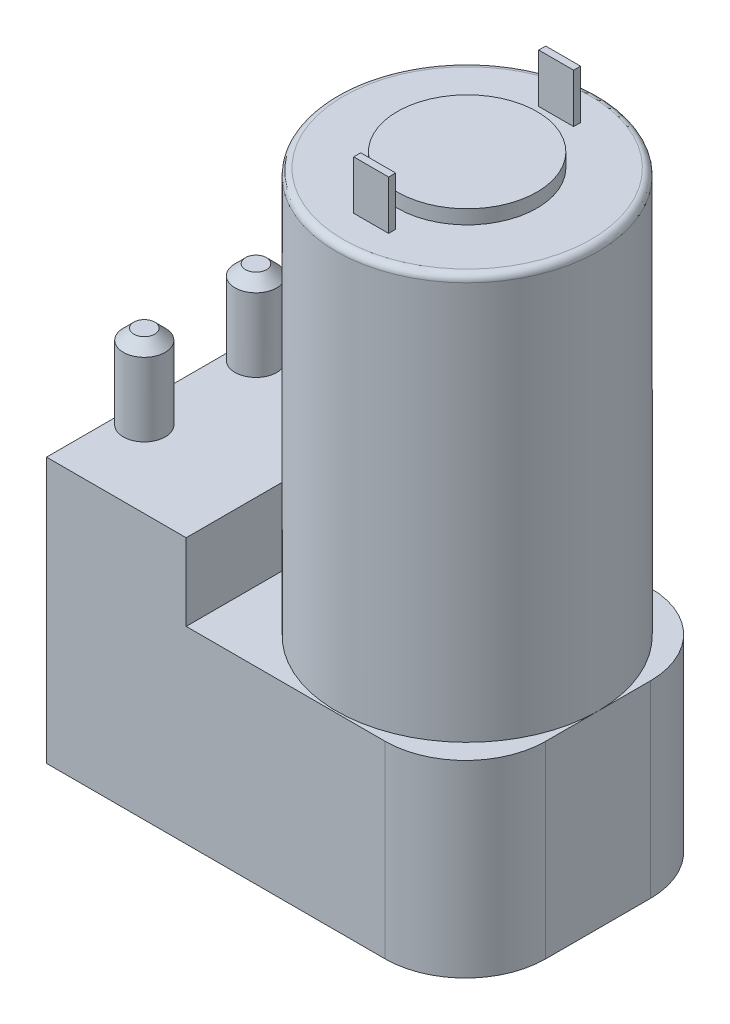
ISO-10303-21;
HEADER;
FILE_DESCRIPTION(('STEP AP214'),'2;1');
FILE_NAME('part.step','',(''),(''),'','','');
FILE_SCHEMA(('AUTOMOTIVE_DESIGN { 1 0 10303 214 1 1 1 1 }'));
ENDSEC;
DATA;
#1=APPLICATION_CONTEXT('core data for automotive mechanical design processes');
#2=APPLICATION_PROTOCOL_DEFINITION('international standard','automotive_design',2000,#1);
#3=PRODUCT_CONTEXT('',#1,'mechanical');
#4=PRODUCT('Part','Part','',(#3));
#5=PRODUCT_RELATED_PRODUCT_CATEGORY('part','',(#4));
#6=PRODUCT_DEFINITION_FORMATION('','',#4);
#7=PRODUCT_DEFINITION_CONTEXT('part definition',#1,'design');
#8=PRODUCT_DEFINITION('design','',#6,#7);
#9=PRODUCT_DEFINITION_SHAPE('','',#8);
#10=(LENGTH_UNIT() NAMED_UNIT(*) SI_UNIT(.MILLI.,.METRE.));
#11=(NAMED_UNIT(*) PLANE_ANGLE_UNIT() SI_UNIT($,.RADIAN.));
#12=(NAMED_UNIT(*) SI_UNIT($,.STERADIAN.) SOLID_ANGLE_UNIT());
#13=UNCERTAINTY_MEASURE_WITH_UNIT(LENGTH_MEASURE(1.E-05),#10,'distance_accuracy_value','');
#14=(GEOMETRIC_REPRESENTATION_CONTEXT(3) GLOBAL_UNCERTAINTY_ASSIGNED_CONTEXT((#13)) GLOBAL_UNIT_ASSIGNED_CONTEXT((#10,
#11,#12)) REPRESENTATION_CONTEXT('',''));
#15=CARTESIAN_POINT('',(0.,0.,0.));
#16=DIRECTION('',(0.,0.,1.));
#17=DIRECTION('',(1.,0.,0.));
#18=AXIS2_PLACEMENT_3D('',#15,#16,#17);
#19=CARTESIAN_POINT('',(41.25,85.,-19.));
#20=DIRECTION('',(0.,1.,0.));
#21=DIRECTION('',(0.,0.,1.));
#22=AXIS2_PLACEMENT_3D('',#19,#20,#21);
#23=PLANE('',#22);
#24=DIRECTION('',(0.,0.,-1.));
#25=VECTOR('',#24,1.);
#26=CARTESIAN_POINT('',(43.75,85.,-5.24999999999998));
#27=LINE('',#26,#25);
#28=CARTESIAN_POINT('',(43.75,85.,-5.24999999999998));
#29=VERTEX_POINT('',#28);
#30=CARTESIAN_POINT('',(43.75,85.,-6.24999999999998));
#31=VERTEX_POINT('',#30);
#32=EDGE_CURVE('E182',#29,#31,#27,.T.);
#33=ORIENTED_EDGE('',*,*,#32,.F.);
#34=DIRECTION('',(1.,0.,0.));
#35=VECTOR('',#34,1.);
#36=CARTESIAN_POINT('',(43.75,85.,-5.24999999999998));
#37=LINE('',#36,#35);
#38=CARTESIAN_POINT('',(38.75,85.,-5.24999999999998));
#39=VERTEX_POINT('',#38);
#40=EDGE_CURVE('E179',#39,#29,#37,.T.);
#41=ORIENTED_EDGE('',*,*,#40,.F.);
#42=DIRECTION('',(0.,0.,1.));
#43=VECTOR('',#42,1.);
#44=CARTESIAN_POINT('',(38.75,85.,-5.24999999999998));
#45=LINE('',#44,#43);
#46=CARTESIAN_POINT('',(38.75,85.,-6.24999999999998));
#47=VERTEX_POINT('',#46);
#48=EDGE_CURVE('E191',#47,#39,#45,.T.);
#49=ORIENTED_EDGE('',*,*,#48,.F.);
#50=DIRECTION('',(-1.,0.,0.));
#51=VECTOR('',#50,1.);
#52=CARTESIAN_POINT('',(38.75,85.,-6.24999999999998));
#53=LINE('',#52,#51);
#54=EDGE_CURVE('E199',#31,#47,#53,.T.);
#55=ORIENTED_EDGE('',*,*,#54,.F.);
#56=EDGE_LOOP('',(#33,#41,#49,#55));
#57=FACE_BOUND('',#56,.T.);
#58=CARTESIAN_POINT('',(41.25,85.,-19.));
#59=DIRECTION('',(0.,1.,0.));
#60=DIRECTION('',(0.,0.,1.));
#61=AXIS2_PLACEMENT_3D('',#58,#59,#60);
#62=CIRCLE('',#61,17.75);
#63=CARTESIAN_POINT('',(41.25,85.,-1.24999999999999));
#64=VERTEX_POINT('',#63);
#65=EDGE_CURVE('E39',#64,#64,#62,.T.);
#66=ORIENTED_EDGE('',*,*,#65,.T.);
#67=EDGE_LOOP('',(#66));
#68=FACE_BOUND('',#67,.T.);
#69=CARTESIAN_POINT('',(41.25,85.,-19.));
#70=DIRECTION('',(0.,1.,0.));
#71=DIRECTION('',(0.,0.,1.));
#72=AXIS2_PLACEMENT_3D('',#69,#70,#71);
#73=CIRCLE('',#72,10.);
#74=CARTESIAN_POINT('',(41.25,85.,-8.99999999999999));
#75=VERTEX_POINT('',#74);
#76=EDGE_CURVE('E215',#75,#75,#73,.T.);
#77=ORIENTED_EDGE('',*,*,#76,.F.);
#78=EDGE_LOOP('',(#77));
#79=FACE_BOUND('',#78,.T.);
#80=DIRECTION('',(1.,0.,0.));
#81=VECTOR('',#80,1.);
#82=CARTESIAN_POINT('',(38.75,85.,-31.75));
#83=LINE('',#82,#81);
#84=CARTESIAN_POINT('',(38.75,85.,-31.75));
#85=VERTEX_POINT('',#84);
#86=CARTESIAN_POINT('',(43.75,85.,-31.75));
#87=VERTEX_POINT('',#86);
#88=EDGE_CURVE('E602',#85,#87,#83,.T.);
#89=ORIENTED_EDGE('',*,*,#88,.F.);
#90=DIRECTION('',(0.,0.,1.));
#91=VECTOR('',#90,1.);
#92=CARTESIAN_POINT('',(38.75,85.,-32.75));
#93=LINE('',#92,#91);
#94=CARTESIAN_POINT('',(38.75,85.,-32.75));
#95=VERTEX_POINT('',#94);
#96=EDGE_CURVE('E177',#95,#85,#93,.T.);
#97=ORIENTED_EDGE('',*,*,#96,.F.);
#98=DIRECTION('',(-1.,0.,0.));
#99=VECTOR('',#98,1.);
#100=CARTESIAN_POINT('',(43.75,85.,-32.75));
#101=LINE('',#100,#99);
#102=CARTESIAN_POINT('',(43.75,85.,-32.75));
#103=VERTEX_POINT('',#102);
#104=EDGE_CURVE('E173',#103,#95,#101,.T.);
#105=ORIENTED_EDGE('',*,*,#104,.F.);
#106=DIRECTION('',(0.,0.,-1.));
#107=VECTOR('',#106,1.);
#108=CARTESIAN_POINT('',(43.75,85.,-32.75));
#109=LINE('',#108,#107);
#110=EDGE_CURVE('E604',#87,#103,#109,.T.);
#111=ORIENTED_EDGE('',*,*,#110,.F.);
#112=EDGE_LOOP('',(#89,#97,#105,#111));
#113=FACE_BOUND('',#112,.T.);
#114=ADVANCED_FACE('F31',(#57,#68,#79,#113),#23,.T.);
#115=CARTESIAN_POINT('',(0.,38.,-38.));
#116=DIRECTION('',(0.,1.,0.));
#117=DIRECTION('',(0.,0.,1.));
#118=AXIS2_PLACEMENT_3D('',#115,#116,#117);
#119=PLANE('',#118);
#120=DIRECTION('',(0.,0.,1.));
#121=VECTOR('',#120,1.);
#122=CARTESIAN_POINT('',(0.,38.,-38.));
#123=LINE('',#122,#121);
#124=CARTESIAN_POINT('',(0.,38.,-27.));
#125=VERTEX_POINT('',#124);
#126=CARTESIAN_POINT('',(0.,38.,-11.));
#127=VERTEX_POINT('',#126);
#128=EDGE_CURVE('E232',#125,#127,#123,.T.);
#129=ORIENTED_EDGE('',*,*,#128,.T.);
#130=CARTESIAN_POINT('',(3.,38.,-11.));
#131=DIRECTION('',(0.,1.,0.));
#132=DIRECTION('',(0.,0.,-1.));
#133=AXIS2_PLACEMENT_3D('',#130,#131,#132);
#134=CIRCLE('',#133,3.);
#135=EDGE_CURVE('E210',#127,#127,#134,.T.);
#136=ORIENTED_EDGE('',*,*,#135,.F.);
#137=CARTESIAN_POINT('',(0.,38.,0.));
#138=VERTEX_POINT('',#137);
#139=EDGE_CURVE('E228',#127,#138,#123,.T.);
#140=ORIENTED_EDGE('',*,*,#139,.T.);
#141=DIRECTION('',(1.,0.,0.));
#142=VECTOR('',#141,1.);
#143=CARTESIAN_POINT('',(0.,38.,0.));
#144=LINE('',#143,#142);
#145=CARTESIAN_POINT('',(20.,38.,0.));
#146=VERTEX_POINT('',#145);
#147=EDGE_CURVE('E231',#138,#146,#144,.T.);
#148=ORIENTED_EDGE('',*,*,#147,.T.);
#149=DIRECTION('',(0.,0.,-1.));
#150=VECTOR('',#149,1.);
#151=CARTESIAN_POINT('',(20.,38.,0.));
#152=LINE('',#151,#150);
#153=CARTESIAN_POINT('',(20.,38.,-38.));
#154=VERTEX_POINT('',#153);
#155=EDGE_CURVE('E234',#146,#154,#152,.T.);
#156=ORIENTED_EDGE('',*,*,#155,.T.);
#157=DIRECTION('',(-1.,0.,0.));
#158=VECTOR('',#157,1.);
#159=CARTESIAN_POINT('',(20.,38.,-38.));
#160=LINE('',#159,#158);
#161=CARTESIAN_POINT('',(0.,38.,-38.));
#162=VERTEX_POINT('',#161);
#163=EDGE_CURVE('E225',#154,#162,#160,.T.);
#164=ORIENTED_EDGE('',*,*,#163,.T.);
#165=EDGE_CURVE('E229',#162,#125,#123,.T.);
#166=ORIENTED_EDGE('',*,*,#165,.T.);
#167=CARTESIAN_POINT('',(3.,38.,-27.));
#168=DIRECTION('',(0.,1.,0.));
#169=DIRECTION('',(0.,0.,1.));
#170=AXIS2_PLACEMENT_3D('',#167,#168,#169);
#171=CIRCLE('',#170,3.);
#172=EDGE_CURVE('E212',#125,#125,#171,.T.);
#173=ORIENTED_EDGE('',*,*,#172,.F.);
#174=EDGE_LOOP('',(#129,#136,#140,#148,#156,#164,#166,#173));
#175=FACE_BOUND('',#174,.T.);
#176=ADVANCED_FACE('F290',(#175),#119,.T.);
#177=CARTESIAN_POINT('',(48.5,27.,-26.5));
#178=DIRECTION('',(0.,-1.,0.));
#179=DIRECTION('',(0.,0.,-1.));
#180=AXIS2_PLACEMENT_3D('',#177,#178,#179);
#181=PLANE('',#180);
#182=DIRECTION('',(0.,0.,-1.));
#183=VECTOR('',#182,1.);
#184=CARTESIAN_POINT('',(60.,27.,-26.5));
#185=LINE('',#184,#183);
#186=CARTESIAN_POINT('',(60.,27.,-11.5));
#187=VERTEX_POINT('',#186);
#188=CARTESIAN_POINT('',(60.,27.,-19.));
#189=VERTEX_POINT('',#188);
#190=EDGE_CURVE('E671',#187,#189,#185,.T.);
#191=ORIENTED_EDGE('',*,*,#190,.T.);
#192=CARTESIAN_POINT('',(41.25,27.,-19.));
#193=DIRECTION('',(0.,1.,0.));
#194=DIRECTION('',(0.,0.,1.));
#195=AXIS2_PLACEMENT_3D('',#192,#193,#194);
#196=CIRCLE('',#195,18.75);
#197=EDGE_CURVE('E219',#189,#189,#196,.T.);
#198=ORIENTED_EDGE('',*,*,#197,.F.);
#199=CARTESIAN_POINT('',(60.,27.,-26.5));
#200=VERTEX_POINT('',#199);
#201=EDGE_CURVE('E657',#189,#200,#185,.T.);
#202=ORIENTED_EDGE('',*,*,#201,.T.);
#203=CARTESIAN_POINT('',(48.5,27.,-26.5));
#204=DIRECTION('',(0.,1.,0.));
#205=DIRECTION('',(0.,0.,-1.));
#206=AXIS2_PLACEMENT_3D('',#203,#204,#205);
#207=CIRCLE('',#206,11.5);
#208=CARTESIAN_POINT('',(48.5,27.,-38.));
#209=VERTEX_POINT('',#208);
#210=EDGE_CURVE('E644',#200,#209,#207,.T.);
#211=ORIENTED_EDGE('',*,*,#210,.T.);
#212=DIRECTION('',(-1.,0.,0.));
#213=VECTOR('',#212,1.);
#214=CARTESIAN_POINT('',(0.,27.,-38.));
#215=LINE('',#214,#213);
#216=CARTESIAN_POINT('',(20.,27.,-38.));
#217=VERTEX_POINT('',#216);
#218=EDGE_CURVE('E245',#209,#217,#215,.T.);
#219=ORIENTED_EDGE('',*,*,#218,.T.);
#220=DIRECTION('',(0.,0.,-1.));
#221=VECTOR('',#220,1.);
#222=CARTESIAN_POINT('',(20.,27.,0.));
#223=LINE('',#222,#221);
#224=CARTESIAN_POINT('',(20.,27.,0.));
#225=VERTEX_POINT('',#224);
#226=EDGE_CURVE('E224',#225,#217,#223,.T.);
#227=ORIENTED_EDGE('',*,*,#226,.F.);
#228=DIRECTION('',(1.,0.,0.));
#229=VECTOR('',#228,1.);
#230=CARTESIAN_POINT('',(0.,27.,0.));
#231=LINE('',#230,#229);
#232=CARTESIAN_POINT('',(48.5,27.,0.));
#233=VERTEX_POINT('',#232);
#234=EDGE_CURVE('E654',#225,#233,#231,.T.);
#235=ORIENTED_EDGE('',*,*,#234,.T.);
#236=CARTESIAN_POINT('',(48.5,27.,-11.5));
#237=DIRECTION('',(0.,1.,0.));
#238=DIRECTION('',(0.,0.,-1.));
#239=AXIS2_PLACEMENT_3D('',#236,#237,#238);
#240=CIRCLE('',#239,11.5);
#241=EDGE_CURVE('E655',#233,#187,#240,.T.);
#242=ORIENTED_EDGE('',*,*,#241,.T.);
#243=EDGE_LOOP('',(#191,#198,#202,#211,#219,#227,#235,#242));
#244=FACE_BOUND('',#243,.T.);
#245=ADVANCED_FACE('F296',(#244),#181,.F.);
#246=CARTESIAN_POINT('',(0.,27.,0.));
#247=DIRECTION('',(1.,0.,0.));
#248=DIRECTION('',(0.,0.,-1.));
#249=AXIS2_PLACEMENT_3D('',#246,#247,#248);
#250=PLANE('',#249);
#251=DIRECTION('',(0.,0.,1.));
#252=VECTOR('',#251,1.);
#253=CARTESIAN_POINT('',(0.,0.,0.));
#254=LINE('',#253,#252);
#255=CARTESIAN_POINT('',(0.,0.,-38.));
#256=VERTEX_POINT('',#255);
#257=CARTESIAN_POINT('',(0.,0.,0.));
#258=VERTEX_POINT('',#257);
#259=EDGE_CURVE('E255',#256,#258,#254,.T.);
#260=ORIENTED_EDGE('',*,*,#259,.T.);
#261=DIRECTION('',(0.,-1.,0.));
#262=VECTOR('',#261,1.);
#263=CARTESIAN_POINT('',(0.,27.,0.));
#264=LINE('',#263,#262);
#265=EDGE_CURVE('E262',#138,#258,#264,.T.);
#266=ORIENTED_EDGE('',*,*,#265,.F.);
#267=ORIENTED_EDGE('',*,*,#139,.F.);
#268=ORIENTED_EDGE('',*,*,#128,.F.);
#269=ORIENTED_EDGE('',*,*,#165,.F.);
#270=DIRECTION('',(0.,-1.,0.));
#271=VECTOR('',#270,1.);
#272=CARTESIAN_POINT('',(0.,27.,-38.));
#273=LINE('',#272,#271);
#274=EDGE_CURVE('E380',#162,#256,#273,.T.);
#275=ORIENTED_EDGE('',*,*,#274,.T.);
#276=EDGE_LOOP('',(#260,#266,#267,#268,#269,#275));
#277=FACE_BOUND('',#276,.T.);
#278=ADVANCED_FACE('F315',(#277),#250,.F.);
#279=CARTESIAN_POINT('',(0.,27.,0.));
#280=DIRECTION('',(0.,0.,-1.));
#281=DIRECTION('',(-1.,0.,0.));
#282=AXIS2_PLACEMENT_3D('',#279,#280,#281);
#283=PLANE('',#282);
#284=DIRECTION('',(1.,0.,0.));
#285=VECTOR('',#284,1.);
#286=CARTESIAN_POINT('',(0.,0.,0.));
#287=LINE('',#286,#285);
#288=CARTESIAN_POINT('',(48.5,0.,0.));
#289=VERTEX_POINT('',#288);
#290=EDGE_CURVE('E666',#258,#289,#287,.T.);
#291=ORIENTED_EDGE('',*,*,#290,.T.);
#292=DIRECTION('',(0.,-1.,0.));
#293=VECTOR('',#292,1.);
#294=CARTESIAN_POINT('',(48.5,27.,0.));
#295=LINE('',#294,#293);
#296=EDGE_CURVE('E372',#233,#289,#295,.T.);
#297=ORIENTED_EDGE('',*,*,#296,.F.);
#298=ORIENTED_EDGE('',*,*,#234,.F.);
#299=DIRECTION('',(0.,-1.,0.));
#300=VECTOR('',#299,1.);
#301=CARTESIAN_POINT('',(20.,38.,0.));
#302=LINE('',#301,#300);
#303=EDGE_CURVE('E250',#146,#225,#302,.T.);
#304=ORIENTED_EDGE('',*,*,#303,.F.);
#305=ORIENTED_EDGE('',*,*,#147,.F.);
#306=ORIENTED_EDGE('',*,*,#265,.T.);
#307=EDGE_LOOP('',(#291,#297,#298,#304,#305,#306));
#308=FACE_BOUND('',#307,.T.);
#309=ADVANCED_FACE('F335',(#308),#283,.F.);
#310=CARTESIAN_POINT('',(48.5,27.,-11.5));
#311=DIRECTION('',(0.,-1.,0.));
#312=DIRECTION('',(0.,0.,-1.));
#313=AXIS2_PLACEMENT_3D('',#310,#311,#312);
#314=CYLINDRICAL_SURFACE('',#313,11.5);
#315=CARTESIAN_POINT('',(48.5,0.,-11.5));
#316=DIRECTION('',(0.,1.,0.));
#317=DIRECTION('',(0.,0.,-1.));
#318=AXIS2_PLACEMENT_3D('',#315,#316,#317);
#319=CIRCLE('',#318,11.5);
#320=CARTESIAN_POINT('',(60.,0.,-11.5));
#321=VERTEX_POINT('',#320);
#322=EDGE_CURVE('E662',#289,#321,#319,.T.);
#323=ORIENTED_EDGE('',*,*,#322,.T.);
#324=DIRECTION('',(0.,-1.,0.));
#325=VECTOR('',#324,1.);
#326=CARTESIAN_POINT('',(60.,27.,-11.5));
#327=LINE('',#326,#325);
#328=EDGE_CURVE('E650',#187,#321,#327,.T.);
#329=ORIENTED_EDGE('',*,*,#328,.F.);
#330=ORIENTED_EDGE('',*,*,#241,.F.);
#331=ORIENTED_EDGE('',*,*,#296,.T.);
#332=EDGE_LOOP('',(#323,#329,#330,#331));
#333=FACE_BOUND('',#332,.T.);
#334=ADVANCED_FACE('F331',(#333),#314,.T.);
#335=CARTESIAN_POINT('',(60.,27.,-26.5));
#336=DIRECTION('',(-1.,0.,0.));
#337=DIRECTION('',(0.,0.,1.));
#338=AXIS2_PLACEMENT_3D('',#335,#336,#337);
#339=PLANE('',#338);
#340=DIRECTION('',(0.,0.,-1.));
#341=VECTOR('',#340,1.);
#342=CARTESIAN_POINT('',(60.,0.,-26.5));
#343=LINE('',#342,#341);
#344=CARTESIAN_POINT('',(60.,0.,-26.5));
#345=VERTEX_POINT('',#344);
#346=EDGE_CURVE('E659',#321,#345,#343,.T.);
#347=ORIENTED_EDGE('',*,*,#346,.T.);
#348=DIRECTION('',(0.,-1.,0.));
#349=VECTOR('',#348,1.);
#350=CARTESIAN_POINT('',(60.,27.,-26.5));
#351=LINE('',#350,#349);
#352=EDGE_CURVE('E642',#200,#345,#351,.T.);
#353=ORIENTED_EDGE('',*,*,#352,.F.);
#354=ORIENTED_EDGE('',*,*,#201,.F.);
#355=ORIENTED_EDGE('',*,*,#190,.F.);
#356=ORIENTED_EDGE('',*,*,#328,.T.);
#357=EDGE_LOOP('',(#347,#353,#354,#355,#356));
#358=FACE_BOUND('',#357,.T.);
#359=ADVANCED_FACE('F327',(#358),#339,.F.);
#360=CARTESIAN_POINT('',(48.5,27.,-26.5));
#361=DIRECTION('',(0.,-1.,0.));
#362=DIRECTION('',(0.,0.,-1.));
#363=AXIS2_PLACEMENT_3D('',#360,#361,#362);
#364=CYLINDRICAL_SURFACE('',#363,11.5);
#365=CARTESIAN_POINT('',(48.5,0.,-26.5));
#366=DIRECTION('',(0.,1.,0.));
#367=DIRECTION('',(0.,0.,-1.));
#368=AXIS2_PLACEMENT_3D('',#365,#366,#367);
#369=CIRCLE('',#368,11.5);
#370=CARTESIAN_POINT('',(48.5,0.,-38.));
#371=VERTEX_POINT('',#370);
#372=EDGE_CURVE('E658',#345,#371,#369,.T.);
#373=ORIENTED_EDGE('',*,*,#372,.T.);
#374=DIRECTION('',(0.,-1.,0.));
#375=VECTOR('',#374,1.);
#376=CARTESIAN_POINT('',(48.5,27.,-38.));
#377=LINE('',#376,#375);
#378=EDGE_CURVE('E384',#209,#371,#377,.T.);
#379=ORIENTED_EDGE('',*,*,#378,.F.);
#380=ORIENTED_EDGE('',*,*,#210,.F.);
#381=ORIENTED_EDGE('',*,*,#352,.T.);
#382=EDGE_LOOP('',(#373,#379,#380,#381));
#383=FACE_BOUND('',#382,.T.);
#384=ADVANCED_FACE('F323',(#383),#364,.T.);
#385=CARTESIAN_POINT('',(0.,27.,-38.));
#386=DIRECTION('',(0.,0.,1.));
#387=DIRECTION('',(1.,0.,0.));
#388=AXIS2_PLACEMENT_3D('',#385,#386,#387);
#389=PLANE('',#388);
#390=DIRECTION('',(-1.,0.,0.));
#391=VECTOR('',#390,1.);
#392=CARTESIAN_POINT('',(0.,0.,-38.));
#393=LINE('',#392,#391);
#394=EDGE_CURVE('E383',#371,#256,#393,.T.);
#395=ORIENTED_EDGE('',*,*,#394,.T.);
#396=ORIENTED_EDGE('',*,*,#274,.F.);
#397=ORIENTED_EDGE('',*,*,#163,.F.);
#398=DIRECTION('',(0.,-1.,0.));
#399=VECTOR('',#398,1.);
#400=CARTESIAN_POINT('',(20.,38.,-38.));
#401=LINE('',#400,#399);
#402=EDGE_CURVE('E236',#154,#217,#401,.T.);
#403=ORIENTED_EDGE('',*,*,#402,.T.);
#404=ORIENTED_EDGE('',*,*,#218,.F.);
#405=ORIENTED_EDGE('',*,*,#378,.T.);
#406=EDGE_LOOP('',(#395,#396,#397,#403,#404,#405));
#407=FACE_BOUND('',#406,.T.);
#408=ADVANCED_FACE('F319',(#407),#389,.F.);
#409=CARTESIAN_POINT('',(48.5,0.,-26.5));
#410=DIRECTION('',(0.,-1.,0.));
#411=DIRECTION('',(0.,0.,-1.));
#412=AXIS2_PLACEMENT_3D('',#409,#410,#411);
#413=PLANE('',#412);
#414=ORIENTED_EDGE('',*,*,#259,.F.);
#415=ORIENTED_EDGE('',*,*,#394,.F.);
#416=ORIENTED_EDGE('',*,*,#372,.F.);
#417=ORIENTED_EDGE('',*,*,#346,.F.);
#418=ORIENTED_EDGE('',*,*,#322,.F.);
#419=ORIENTED_EDGE('',*,*,#290,.F.);
#420=EDGE_LOOP('',(#414,#415,#416,#417,#418,#419));
#421=FACE_BOUND('',#420,.T.);
#422=ADVANCED_FACE('F311',(#421),#413,.T.);
#423=CARTESIAN_POINT('',(20.,38.,0.));
#424=DIRECTION('',(-1.,0.,0.));
#425=DIRECTION('',(0.,0.,1.));
#426=AXIS2_PLACEMENT_3D('',#423,#424,#425);
#427=PLANE('',#426);
#428=ORIENTED_EDGE('',*,*,#226,.T.);
#429=ORIENTED_EDGE('',*,*,#402,.F.);
#430=ORIENTED_EDGE('',*,*,#155,.F.);
#431=ORIENTED_EDGE('',*,*,#303,.T.);
#432=EDGE_LOOP('',(#428,#429,#430,#431));
#433=FACE_BOUND('',#432,.T.);
#434=ADVANCED_FACE('F306',(#433),#427,.F.);
#435=CARTESIAN_POINT('',(41.25,85.,-19.));
#436=DIRECTION('',(0.,-1.,0.));
#437=DIRECTION('',(0.,0.,-1.));
#438=AXIS2_PLACEMENT_3D('',#435,#436,#437);
#439=CYLINDRICAL_SURFACE('',#438,18.75);
#440=CARTESIAN_POINT('',(41.25,84.,-19.));
#441=DIRECTION('',(0.,1.,0.));
#442=DIRECTION('',(0.,0.,1.));
#443=AXIS2_PLACEMENT_3D('',#440,#441,#442);
#444=CIRCLE('',#443,18.75);
#445=CARTESIAN_POINT('',(41.25,84.,-0.24999999999999));
#446=VERTEX_POINT('',#445);
#447=EDGE_CURVE('E11',#446,#446,#444,.F.);
#448=ORIENTED_EDGE('',*,*,#447,.T.);
#449=EDGE_LOOP('',(#448));
#450=FACE_BOUND('',#449,.T.);
#451=ORIENTED_EDGE('',*,*,#197,.T.);
#452=EDGE_LOOP('',(#451));
#453=FACE_BOUND('',#452,.T.);
#454=ADVANCED_FACE('F304',(#450,#453),#439,.T.);
#455=CARTESIAN_POINT('',(41.25,87.,-19.));
#456=DIRECTION('',(0.,-1.,0.));
#457=DIRECTION('',(0.,0.,-1.));
#458=AXIS2_PLACEMENT_3D('',#455,#456,#457);
#459=CYLINDRICAL_SURFACE('',#458,10.);
#460=CARTESIAN_POINT('',(41.25,87.,-19.));
#461=DIRECTION('',(0.,1.,0.));
#462=DIRECTION('',(0.,0.,1.));
#463=AXIS2_PLACEMENT_3D('',#460,#461,#462);
#464=CIRCLE('',#463,10.);
#465=CARTESIAN_POINT('',(41.25,87.,-8.99999999999999));
#466=VERTEX_POINT('',#465);
#467=EDGE_CURVE('E216',#466,#466,#464,.T.);
#468=ORIENTED_EDGE('',*,*,#467,.F.);
#469=EDGE_LOOP('',(#468));
#470=FACE_BOUND('',#469,.T.);
#471=ORIENTED_EDGE('',*,*,#76,.T.);
#472=EDGE_LOOP('',(#471));
#473=FACE_BOUND('',#472,.T.);
#474=ADVANCED_FACE('F302',(#470,#473),#459,.T.);
#475=CARTESIAN_POINT('',(41.25,87.,-19.));
#476=DIRECTION('',(0.,1.,0.));
#477=DIRECTION('',(0.,0.,1.));
#478=AXIS2_PLACEMENT_3D('',#475,#476,#477);
#479=PLANE('',#478);
#480=ORIENTED_EDGE('',*,*,#467,.T.);
#481=EDGE_LOOP('',(#480));
#482=FACE_BOUND('',#481,.T.);
#483=ADVANCED_FACE('F389',(#482),#479,.T.);
#484=CARTESIAN_POINT('',(3.,50.,-27.));
#485=DIRECTION('',(0.,-1.,0.));
#486=DIRECTION('',(0.,0.,-1.));
#487=AXIS2_PLACEMENT_3D('',#484,#485,#486);
#488=CYLINDRICAL_SURFACE('',#487,3.);
#489=CARTESIAN_POINT('',(3.,48.5,-27.));
#490=DIRECTION('',(0.,1.,0.));
#491=DIRECTION('',(0.,0.,1.));
#492=AXIS2_PLACEMENT_3D('',#489,#490,#491);
#493=CIRCLE('',#492,3.);
#494=CARTESIAN_POINT('',(3.,48.5,-24.));
#495=VERTEX_POINT('',#494);
#496=EDGE_CURVE('E268',#495,#495,#493,.F.);
#497=ORIENTED_EDGE('',*,*,#496,.T.);
#498=EDGE_LOOP('',(#497));
#499=FACE_BOUND('',#498,.T.);
#500=ORIENTED_EDGE('',*,*,#172,.T.);
#501=EDGE_LOOP('',(#500));
#502=FACE_BOUND('',#501,.T.);
#503=ADVANCED_FACE('F387',(#499,#502),#488,.T.);
#504=CARTESIAN_POINT('',(3.,50.,-27.));
#505=DIRECTION('',(0.,1.,0.));
#506=DIRECTION('',(0.,0.,1.));
#507=AXIS2_PLACEMENT_3D('',#504,#505,#506);
#508=PLANE('',#507);
#509=CARTESIAN_POINT('',(3.,50.,-27.));
#510=DIRECTION('',(0.,1.,0.));
#511=DIRECTION('',(0.,0.,1.));
#512=AXIS2_PLACEMENT_3D('',#509,#510,#511);
#513=CIRCLE('',#512,1.5);
#514=CARTESIAN_POINT('',(3.,50.,-25.5));
#515=VERTEX_POINT('',#514);
#516=EDGE_CURVE('E265',#515,#515,#513,.T.);
#517=ORIENTED_EDGE('',*,*,#516,.T.);
#518=EDGE_LOOP('',(#517));
#519=FACE_BOUND('',#518,.T.);
#520=ADVANCED_FACE('F358',(#519),#508,.T.);
#521=CARTESIAN_POINT('',(3.,50.,-11.));
#522=DIRECTION('',(0.,-1.,0.));
#523=DIRECTION('',(0.,0.,-1.));
#524=AXIS2_PLACEMENT_3D('',#521,#522,#523);
#525=CYLINDRICAL_SURFACE('',#524,3.);
#526=CARTESIAN_POINT('',(3.,48.5,-11.));
#527=DIRECTION('',(0.,-1.,0.));
#528=DIRECTION('',(0.,0.,-1.));
#529=AXIS2_PLACEMENT_3D('',#526,#527,#528);
#530=CIRCLE('',#529,3.);
#531=CARTESIAN_POINT('',(3.,48.5,-14.));
#532=VERTEX_POINT('',#531);
#533=EDGE_CURVE('E261',#532,#532,#530,.T.);
#534=ORIENTED_EDGE('',*,*,#533,.T.);
#535=EDGE_LOOP('',(#534));
#536=FACE_BOUND('',#535,.T.);
#537=ORIENTED_EDGE('',*,*,#135,.T.);
#538=EDGE_LOOP('',(#537));
#539=FACE_BOUND('',#538,.T.);
#540=ADVANCED_FACE('F349',(#536,#539),#525,.T.);
#541=CARTESIAN_POINT('',(3.,50.,-11.));
#542=DIRECTION('',(0.,-1.,0.));
#543=DIRECTION('',(0.,0.,-1.));
#544=AXIS2_PLACEMENT_3D('',#541,#542,#543);
#545=PLANE('',#544);
#546=CARTESIAN_POINT('',(3.,50.,-11.));
#547=DIRECTION('',(0.,-1.,0.));
#548=DIRECTION('',(0.,0.,-1.));
#549=AXIS2_PLACEMENT_3D('',#546,#547,#548);
#550=CIRCLE('',#549,1.5);
#551=CARTESIAN_POINT('',(3.,50.,-12.5));
#552=VERTEX_POINT('',#551);
#553=EDGE_CURVE('E258',#552,#552,#550,.F.);
#554=ORIENTED_EDGE('',*,*,#553,.T.);
#555=EDGE_LOOP('',(#554));
#556=FACE_BOUND('',#555,.T.);
#557=ADVANCED_FACE('F344',(#556),#545,.F.);
#558=CARTESIAN_POINT('',(3.,50.,-11.));
#559=DIRECTION('',(0.,-1.,0.));
#560=DIRECTION('',(0.,0.,-1.));
#561=AXIS2_PLACEMENT_3D('',#558,#559,#560);
#562=CONICAL_SURFACE('',#561,1.5,0.785398163397449);
#563=ORIENTED_EDGE('',*,*,#533,.F.);
#564=EDGE_LOOP('',(#563));
#565=FACE_BOUND('',#564,.T.);
#566=ORIENTED_EDGE('',*,*,#553,.F.);
#567=EDGE_LOOP('',(#566));
#568=FACE_BOUND('',#567,.T.);
#569=ADVANCED_FACE('F286',(#565,#568),#562,.T.);
#570=CARTESIAN_POINT('',(3.,50.,-27.));
#571=DIRECTION('',(0.,-1.,0.));
#572=DIRECTION('',(0.,0.,-1.));
#573=AXIS2_PLACEMENT_3D('',#570,#571,#572);
#574=CONICAL_SURFACE('',#573,1.5,0.785398163397444);
#575=ORIENTED_EDGE('',*,*,#496,.F.);
#576=EDGE_LOOP('',(#575));
#577=FACE_BOUND('',#576,.T.);
#578=ORIENTED_EDGE('',*,*,#516,.F.);
#579=EDGE_LOOP('',(#578));
#580=FACE_BOUND('',#579,.T.);
#581=ADVANCED_FACE('F277',(#577,#580),#574,.T.);
#582=CARTESIAN_POINT('',(41.25,84.,-19.));
#583=DIRECTION('',(0.,1.,0.));
#584=DIRECTION('',(0.,0.,1.));
#585=AXIS2_PLACEMENT_3D('',#582,#583,#584);
#586=TOROIDAL_SURFACE('',#585,17.75,1.);
#587=ORIENTED_EDGE('',*,*,#447,.F.);
#588=EDGE_LOOP('',(#587));
#589=FACE_BOUND('',#588,.T.);
#590=ORIENTED_EDGE('',*,*,#65,.F.);
#591=EDGE_LOOP('',(#590));
#592=FACE_BOUND('',#591,.T.);
#593=ADVANCED_FACE('F33',(#589,#592),#586,.T.);
#594=CARTESIAN_POINT('',(43.75,92.,-5.24999999999998));
#595=DIRECTION('',(0.,0.,-1.));
#596=DIRECTION('',(-1.,0.,0.));
#597=AXIS2_PLACEMENT_3D('',#594,#595,#596);
#598=PLANE('',#597);
#599=ORIENTED_EDGE('',*,*,#40,.T.);
#600=DIRECTION('',(0.,-1.,0.));
#601=VECTOR('',#600,1.);
#602=CARTESIAN_POINT('',(43.75,92.,-5.24999999999998));
#603=LINE('',#602,#601);
#604=CARTESIAN_POINT('',(43.75,92.,-5.24999999999998));
#605=VERTEX_POINT('',#604);
#606=EDGE_CURVE('E208',#605,#29,#603,.T.);
#607=ORIENTED_EDGE('',*,*,#606,.F.);
#608=DIRECTION('',(1.,0.,0.));
#609=VECTOR('',#608,1.);
#610=CARTESIAN_POINT('',(43.75,92.,-5.24999999999998));
#611=LINE('',#610,#609);
#612=CARTESIAN_POINT('',(38.75,92.,-5.24999999999998));
#613=VERTEX_POINT('',#612);
#614=EDGE_CURVE('E187',#613,#605,#611,.T.);
#615=ORIENTED_EDGE('',*,*,#614,.F.);
#616=DIRECTION('',(0.,-1.,0.));
#617=VECTOR('',#616,1.);
#618=CARTESIAN_POINT('',(38.75,92.,-5.24999999999998));
#619=LINE('',#618,#617);
#620=EDGE_CURVE('E196',#613,#39,#619,.T.);
#621=ORIENTED_EDGE('',*,*,#620,.T.);
#622=EDGE_LOOP('',(#599,#607,#615,#621));
#623=FACE_BOUND('',#622,.T.);
#624=ADVANCED_FACE('F276',(#623),#598,.F.);
#625=CARTESIAN_POINT('',(43.75,92.,-5.24999999999998));
#626=DIRECTION('',(-1.,0.,0.));
#627=DIRECTION('',(0.,0.,1.));
#628=AXIS2_PLACEMENT_3D('',#625,#626,#627);
#629=PLANE('',#628);
#630=ORIENTED_EDGE('',*,*,#32,.T.);
#631=DIRECTION('',(0.,-1.,0.));
#632=VECTOR('',#631,1.);
#633=CARTESIAN_POINT('',(43.75,92.,-6.24999999999998));
#634=LINE('',#633,#632);
#635=CARTESIAN_POINT('',(43.75,92.,-6.24999999999998));
#636=VERTEX_POINT('',#635);
#637=EDGE_CURVE('E205',#636,#31,#634,.T.);
#638=ORIENTED_EDGE('',*,*,#637,.F.);
#639=DIRECTION('',(0.,0.,-1.));
#640=VECTOR('',#639,1.);
#641=CARTESIAN_POINT('',(43.75,92.,-5.24999999999998));
#642=LINE('',#641,#640);
#643=EDGE_CURVE('E190',#605,#636,#642,.T.);
#644=ORIENTED_EDGE('',*,*,#643,.F.);
#645=ORIENTED_EDGE('',*,*,#606,.T.);
#646=EDGE_LOOP('',(#630,#638,#644,#645));
#647=FACE_BOUND('',#646,.T.);
#648=ADVANCED_FACE('F283',(#647),#629,.F.);
#649=CARTESIAN_POINT('',(38.75,92.,-6.24999999999998));
#650=DIRECTION('',(0.,0.,1.));
#651=DIRECTION('',(1.,0.,0.));
#652=AXIS2_PLACEMENT_3D('',#649,#650,#651);
#653=PLANE('',#652);
#654=ORIENTED_EDGE('',*,*,#54,.T.);
#655=DIRECTION('',(0.,-1.,0.));
#656=VECTOR('',#655,1.);
#657=CARTESIAN_POINT('',(38.75,92.,-6.24999999999998));
#658=LINE('',#657,#656);
#659=CARTESIAN_POINT('',(38.75,92.,-6.24999999999998));
#660=VERTEX_POINT('',#659);
#661=EDGE_CURVE('E54',#660,#47,#658,.T.);
#662=ORIENTED_EDGE('',*,*,#661,.F.);
#663=DIRECTION('',(-1.,0.,0.));
#664=VECTOR('',#663,1.);
#665=CARTESIAN_POINT('',(38.75,92.,-6.24999999999998));
#666=LINE('',#665,#664);
#667=EDGE_CURVE('E193',#636,#660,#666,.T.);
#668=ORIENTED_EDGE('',*,*,#667,.F.);
#669=ORIENTED_EDGE('',*,*,#637,.T.);
#670=EDGE_LOOP('',(#654,#662,#668,#669));
#671=FACE_BOUND('',#670,.T.);
#672=ADVANCED_FACE('F402',(#671),#653,.F.);
#673=CARTESIAN_POINT('',(38.75,92.,-5.24999999999998));
#674=DIRECTION('',(1.,0.,0.));
#675=DIRECTION('',(0.,0.,-1.));
#676=AXIS2_PLACEMENT_3D('',#673,#674,#675);
#677=PLANE('',#676);
#678=ORIENTED_EDGE('',*,*,#48,.T.);
#679=ORIENTED_EDGE('',*,*,#620,.F.);
#680=DIRECTION('',(0.,0.,1.));
#681=VECTOR('',#680,1.);
#682=CARTESIAN_POINT('',(38.75,92.,-5.24999999999998));
#683=LINE('',#682,#681);
#684=EDGE_CURVE('E195',#660,#613,#683,.T.);
#685=ORIENTED_EDGE('',*,*,#684,.F.);
#686=ORIENTED_EDGE('',*,*,#661,.T.);
#687=EDGE_LOOP('',(#678,#679,#685,#686));
#688=FACE_BOUND('',#687,.T.);
#689=ADVANCED_FACE('F406',(#688),#677,.F.);
#690=CARTESIAN_POINT('',(38.75,92.,-5.24999999999998));
#691=DIRECTION('',(0.,-1.,0.));
#692=DIRECTION('',(0.,0.,-1.));
#693=AXIS2_PLACEMENT_3D('',#690,#691,#692);
#694=PLANE('',#693);
#695=ORIENTED_EDGE('',*,*,#614,.T.);
#696=ORIENTED_EDGE('',*,*,#643,.T.);
#697=ORIENTED_EDGE('',*,*,#667,.T.);
#698=ORIENTED_EDGE('',*,*,#684,.T.);
#699=EDGE_LOOP('',(#695,#696,#697,#698));
#700=FACE_BOUND('',#699,.T.);
#701=ADVANCED_FACE('F410',(#700),#694,.F.);
#702=CARTESIAN_POINT('',(38.75,92.,-32.75));
#703=DIRECTION('',(1.,0.,0.));
#704=DIRECTION('',(0.,0.,-1.));
#705=AXIS2_PLACEMENT_3D('',#702,#703,#704);
#706=PLANE('',#705);
#707=ORIENTED_EDGE('',*,*,#96,.T.);
#708=DIRECTION('',(0.,-1.,0.));
#709=VECTOR('',#708,1.);
#710=CARTESIAN_POINT('',(38.75,92.,-31.75));
#711=LINE('',#710,#709);
#712=CARTESIAN_POINT('',(38.75,92.,-31.75));
#713=VERTEX_POINT('',#712);
#714=EDGE_CURVE('E158',#713,#85,#711,.T.);
#715=ORIENTED_EDGE('',*,*,#714,.F.);
#716=DIRECTION('',(0.,0.,1.));
#717=VECTOR('',#716,1.);
#718=CARTESIAN_POINT('',(38.75,92.,-32.75));
#719=LINE('',#718,#717);
#720=CARTESIAN_POINT('',(38.75,92.,-32.75));
#721=VERTEX_POINT('',#720);
#722=EDGE_CURVE('E165',#721,#713,#719,.T.);
#723=ORIENTED_EDGE('',*,*,#722,.F.);
#724=DIRECTION('',(0.,-1.,0.));
#725=VECTOR('',#724,1.);
#726=CARTESIAN_POINT('',(38.75,92.,-32.75));
#727=LINE('',#726,#725);
#728=EDGE_CURVE('E611',#721,#95,#727,.T.);
#729=ORIENTED_EDGE('',*,*,#728,.T.);
#730=EDGE_LOOP('',(#707,#715,#723,#729));
#731=FACE_BOUND('',#730,.T.);
#732=ADVANCED_FACE('F175',(#731),#706,.F.);
#733=CARTESIAN_POINT('',(38.75,92.,-31.75));
#734=DIRECTION('',(0.,0.,-1.));
#735=DIRECTION('',(-1.,0.,0.));
#736=AXIS2_PLACEMENT_3D('',#733,#734,#735);
#737=PLANE('',#736);
#738=ORIENTED_EDGE('',*,*,#88,.T.);
#739=DIRECTION('',(0.,-1.,0.));
#740=VECTOR('',#739,1.);
#741=CARTESIAN_POINT('',(43.75,92.,-31.75));
#742=LINE('',#741,#740);
#743=CARTESIAN_POINT('',(43.75,92.,-31.75));
#744=VERTEX_POINT('',#743);
#745=EDGE_CURVE('E161',#744,#87,#742,.T.);
#746=ORIENTED_EDGE('',*,*,#745,.F.);
#747=DIRECTION('',(1.,0.,0.));
#748=VECTOR('',#747,1.);
#749=CARTESIAN_POINT('',(38.75,92.,-31.75));
#750=LINE('',#749,#748);
#751=EDGE_CURVE('E154',#713,#744,#750,.T.);
#752=ORIENTED_EDGE('',*,*,#751,.F.);
#753=ORIENTED_EDGE('',*,*,#714,.T.);
#754=EDGE_LOOP('',(#738,#746,#752,#753));
#755=FACE_BOUND('',#754,.T.);
#756=ADVANCED_FACE('F156',(#755),#737,.F.);
#757=CARTESIAN_POINT('',(43.75,92.,-32.75));
#758=DIRECTION('',(-1.,0.,0.));
#759=DIRECTION('',(0.,0.,1.));
#760=AXIS2_PLACEMENT_3D('',#757,#758,#759);
#761=PLANE('',#760);
#762=ORIENTED_EDGE('',*,*,#110,.T.);
#763=DIRECTION('',(0.,-1.,0.));
#764=VECTOR('',#763,1.);
#765=CARTESIAN_POINT('',(43.75,92.,-32.75));
#766=LINE('',#765,#764);
#767=CARTESIAN_POINT('',(43.75,92.,-32.75));
#768=VERTEX_POINT('',#767);
#769=EDGE_CURVE('E46',#768,#103,#766,.T.);
#770=ORIENTED_EDGE('',*,*,#769,.F.);
#771=DIRECTION('',(0.,0.,-1.));
#772=VECTOR('',#771,1.);
#773=CARTESIAN_POINT('',(43.75,92.,-32.75));
#774=LINE('',#773,#772);
#775=EDGE_CURVE('E164',#744,#768,#774,.T.);
#776=ORIENTED_EDGE('',*,*,#775,.F.);
#777=ORIENTED_EDGE('',*,*,#745,.T.);
#778=EDGE_LOOP('',(#762,#770,#776,#777));
#779=FACE_BOUND('',#778,.T.);
#780=ADVANCED_FACE('F418',(#779),#761,.F.);
#781=CARTESIAN_POINT('',(43.75,92.,-32.75));
#782=DIRECTION('',(0.,0.,1.));
#783=DIRECTION('',(1.,0.,0.));
#784=AXIS2_PLACEMENT_3D('',#781,#782,#783);
#785=PLANE('',#784);
#786=ORIENTED_EDGE('',*,*,#104,.T.);
#787=ORIENTED_EDGE('',*,*,#728,.F.);
#788=DIRECTION('',(-1.,0.,0.));
#789=VECTOR('',#788,1.);
#790=CARTESIAN_POINT('',(43.75,92.,-32.75));
#791=LINE('',#790,#789);
#792=EDGE_CURVE('E169',#768,#721,#791,.T.);
#793=ORIENTED_EDGE('',*,*,#792,.F.);
#794=ORIENTED_EDGE('',*,*,#769,.T.);
#795=EDGE_LOOP('',(#786,#787,#793,#794));
#796=FACE_BOUND('',#795,.T.);
#797=ADVANCED_FACE('F421',(#796),#785,.F.);
#798=CARTESIAN_POINT('',(38.75,92.,-31.75));
#799=DIRECTION('',(0.,1.,0.));
#800=DIRECTION('',(0.,0.,1.));
#801=AXIS2_PLACEMENT_3D('',#798,#799,#800);
#802=PLANE('',#801);
#803=ORIENTED_EDGE('',*,*,#722,.T.);
#804=ORIENTED_EDGE('',*,*,#751,.T.);
#805=ORIENTED_EDGE('',*,*,#775,.T.);
#806=ORIENTED_EDGE('',*,*,#792,.T.);
#807=EDGE_LOOP('',(#803,#804,#805,#806));
#808=FACE_BOUND('',#807,.T.);
#809=ADVANCED_FACE('F168',(#808),#802,.T.);
#810=CLOSED_SHELL('',(#114,#176,#245,#278,#309,#334,#359,#384,#408,#422,#434,#454,#474,#483,
#503,#520,#540,#557,#569,#581,#593,#624,#648,#672,#689,#701,#732,#756,#780,#797,#809));
#811=MANIFOLD_SOLID_BREP('B2',#810);
#812=ADVANCED_BREP_SHAPE_REPRESENTATION('',(#18,#811),#14);
#813=SHAPE_DEFINITION_REPRESENTATION(#9,#812);
ENDSEC;
END-ISO-10303-21;
